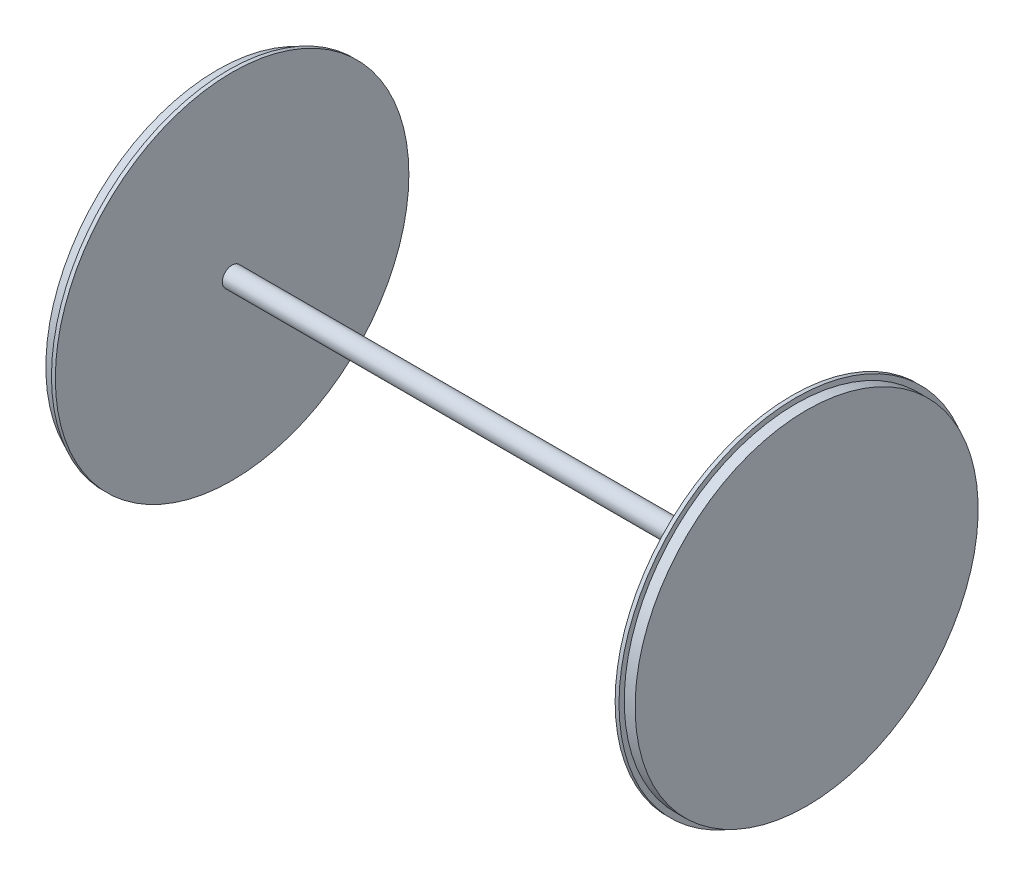
ISO-10303-21;
HEADER;
FILE_DESCRIPTION(('STEP AP214'),'2;1');
FILE_NAME('part.step','',(''),(''),'','','');
FILE_SCHEMA(('AUTOMOTIVE_DESIGN { 1 0 10303 214 1 1 1 1 }'));
ENDSEC;
DATA;
#1=APPLICATION_CONTEXT('core data for automotive mechanical design processes');
#2=APPLICATION_PROTOCOL_DEFINITION('international standard','automotive_design',2000,#1);
#3=PRODUCT_CONTEXT('',#1,'mechanical');
#4=PRODUCT('Part','Part','',(#3));
#5=PRODUCT_RELATED_PRODUCT_CATEGORY('part','',(#4));
#6=PRODUCT_DEFINITION_FORMATION('','',#4);
#7=PRODUCT_DEFINITION_CONTEXT('part definition',#1,'design');
#8=PRODUCT_DEFINITION('design','',#6,#7);
#9=PRODUCT_DEFINITION_SHAPE('','',#8);
#10=(LENGTH_UNIT() NAMED_UNIT(*) SI_UNIT(.MILLI.,.METRE.));
#11=(NAMED_UNIT(*) PLANE_ANGLE_UNIT() SI_UNIT($,.RADIAN.));
#12=(NAMED_UNIT(*) SI_UNIT($,.STERADIAN.) SOLID_ANGLE_UNIT());
#13=UNCERTAINTY_MEASURE_WITH_UNIT(LENGTH_MEASURE(1.E-05),#10,'distance_accuracy_value','');
#14=(GEOMETRIC_REPRESENTATION_CONTEXT(3) GLOBAL_UNCERTAINTY_ASSIGNED_CONTEXT((#13)) GLOBAL_UNIT_ASSIGNED_CONTEXT((#10,
#11,#12)) REPRESENTATION_CONTEXT('',''));
#15=CARTESIAN_POINT('',(0.,0.,0.));
#16=DIRECTION('',(0.,0.,1.));
#17=DIRECTION('',(1.,0.,0.));
#18=AXIS2_PLACEMENT_3D('',#15,#16,#17);
#19=CARTESIAN_POINT('',(0.,887.22,0.));
#20=DIRECTION('',(1.,0.,0.));
#21=DIRECTION('',(0.,1.,0.));
#22=AXIS2_PLACEMENT_3D('',#19,#20,#21);
#23=PLANE('',#22);
#24=CARTESIAN_POINT('',(1.08653113313951E-13,0.,0.));
#25=DIRECTION('',(1.,0.,0.));
#26=DIRECTION('',(0.,1.,0.));
#27=AXIS2_PLACEMENT_3D('',#24,#25,#26);
#28=CIRCLE('',#27,887.22);
#29=CARTESIAN_POINT('',(0.,887.22,0.));
#30=VERTEX_POINT('',#29);
#31=EDGE_CURVE('E65',#30,#30,#28,.T.);
#32=ORIENTED_EDGE('',*,*,#31,.T.);
#33=EDGE_LOOP('',(#32));
#34=FACE_BOUND('',#33,.T.);
#35=ADVANCED_FACE('F31',(#34),#23,.T.);
#36=CARTESIAN_POINT('',(-3048.,-3.73272344380113E-13,0.));
#37=DIRECTION('',(-1.,0.,0.));
#38=DIRECTION('',(0.,-1.,0.));
#39=AXIS2_PLACEMENT_3D('',#36,#37,#38);
#40=PLANE('',#39);
#41=CARTESIAN_POINT('',(-3048.,-3.73272344380113E-13,0.));
#42=DIRECTION('',(1.,0.,0.));
#43=DIRECTION('',(0.,1.,0.));
#44=AXIS2_PLACEMENT_3D('',#41,#42,#43);
#45=CIRCLE('',#44,887.22);
#46=CARTESIAN_POINT('',(-3048.,887.22,0.));
#47=VERTEX_POINT('',#46);
#48=EDGE_CURVE('E10',#47,#47,#45,.T.);
#49=ORIENTED_EDGE('',*,*,#48,.F.);
#50=EDGE_LOOP('',(#49));
#51=FACE_BOUND('',#50,.T.);
#52=ADVANCED_FACE('F82',(#51),#40,.T.);
#53=CARTESIAN_POINT('',(0.,0.,0.));
#54=DIRECTION('',(1.,0.,0.));
#55=DIRECTION('',(0.,1.,0.));
#56=AXIS2_PLACEMENT_3D('',#53,#54,#55);
#57=CYLINDRICAL_SURFACE('',#56,887.22);
#58=ORIENTED_EDGE('',*,*,#48,.T.);
#59=EDGE_LOOP('',(#58));
#60=FACE_BOUND('',#59,.T.);
#61=CARTESIAN_POINT('',(-2991.8,-3.66389829368905E-13,0.));
#62=DIRECTION('',(1.,0.,0.));
#63=DIRECTION('',(0.,1.,0.));
#64=AXIS2_PLACEMENT_3D('',#61,#62,#63);
#65=CIRCLE('',#64,887.22);
#66=CARTESIAN_POINT('',(-2991.8,887.22,0.));
#67=VERTEX_POINT('',#66);
#68=EDGE_CURVE('E37',#67,#67,#65,.T.);
#69=ORIENTED_EDGE('',*,*,#68,.F.);
#70=EDGE_LOOP('',(#69));
#71=FACE_BOUND('',#70,.T.);
#72=ADVANCED_FACE('F86',(#60,#71),#57,.T.);
#73=CARTESIAN_POINT('',(-2991.8,914.4,0.));
#74=DIRECTION('',(-1.,0.,0.));
#75=DIRECTION('',(0.,-1.,0.));
#76=AXIS2_PLACEMENT_3D('',#73,#74,#75);
#77=PLANE('',#76);
#78=ORIENTED_EDGE('',*,*,#68,.T.);
#79=EDGE_LOOP('',(#78));
#80=FACE_BOUND('',#79,.T.);
#81=CARTESIAN_POINT('',(-2991.8,-3.66389829368905E-13,0.));
#82=DIRECTION('',(1.,0.,0.));
#83=DIRECTION('',(0.,1.,0.));
#84=AXIS2_PLACEMENT_3D('',#81,#82,#83);
#85=CIRCLE('',#84,914.4);
#86=CARTESIAN_POINT('',(-2991.8,914.4,0.));
#87=VERTEX_POINT('',#86);
#88=EDGE_CURVE('E41',#87,#87,#85,.T.);
#89=ORIENTED_EDGE('',*,*,#88,.F.);
#90=EDGE_LOOP('',(#89));
#91=FACE_BOUND('',#90,.T.);
#92=ADVANCED_FACE('F91',(#80,#91),#77,.T.);
#93=CARTESIAN_POINT('',(0.,0.,0.));
#94=DIRECTION('',(1.,0.,0.));
#95=DIRECTION('',(0.,1.,0.));
#96=AXIS2_PLACEMENT_3D('',#93,#94,#95);
#97=CYLINDRICAL_SURFACE('',#96,914.4);
#98=ORIENTED_EDGE('',*,*,#88,.T.);
#99=EDGE_LOOP('',(#98));
#100=FACE_BOUND('',#99,.T.);
#101=CARTESIAN_POINT('',(-2971.8,-3.6394053577061E-13,0.));
#102=DIRECTION('',(1.,0.,0.));
#103=DIRECTION('',(0.,1.,0.));
#104=AXIS2_PLACEMENT_3D('',#101,#102,#103);
#105=CIRCLE('',#104,914.4);
#106=CARTESIAN_POINT('',(-2971.8,914.4,0.));
#107=VERTEX_POINT('',#106);
#108=EDGE_CURVE('E45',#107,#107,#105,.T.);
#109=ORIENTED_EDGE('',*,*,#108,.F.);
#110=EDGE_LOOP('',(#109));
#111=FACE_BOUND('',#110,.T.);
#112=ADVANCED_FACE('F96',(#100,#111),#97,.T.);
#113=CARTESIAN_POINT('',(-2971.8,914.4,0.));
#114=DIRECTION('',(1.,0.,0.));
#115=DIRECTION('',(0.,1.,0.));
#116=AXIS2_PLACEMENT_3D('',#113,#114,#115);
#117=PLANE('',#116);
#118=ORIENTED_EDGE('',*,*,#108,.T.);
#119=EDGE_LOOP('',(#118));
#120=FACE_BOUND('',#119,.T.);
#121=CARTESIAN_POINT('',(-2971.8,-3.63940535770611E-13,0.));
#122=DIRECTION('',(1.,0.,0.));
#123=DIRECTION('',(0.,1.,0.));
#124=AXIS2_PLACEMENT_3D('',#121,#122,#123);
#125=CIRCLE('',#124,50.8000000000003);
#126=CARTESIAN_POINT('',(-2971.8,50.8,0.));
#127=VERTEX_POINT('',#126);
#128=EDGE_CURVE('E50',#127,#127,#125,.T.);
#129=ORIENTED_EDGE('',*,*,#128,.F.);
#130=EDGE_LOOP('',(#129));
#131=FACE_BOUND('',#130,.T.);
#132=ADVANCED_FACE('F99',(#120,#131),#117,.T.);
#133=CARTESIAN_POINT('',(0.,0.,0.));
#134=DIRECTION('',(1.,0.,0.));
#135=DIRECTION('',(0.,1.,0.));
#136=AXIS2_PLACEMENT_3D('',#133,#134,#135);
#137=CYLINDRICAL_SURFACE('',#136,50.8000000000002);
#138=ORIENTED_EDGE('',*,*,#128,.T.);
#139=EDGE_LOOP('',(#138));
#140=FACE_BOUND('',#139,.T.);
#141=CARTESIAN_POINT('',(-76.2,0.,0.));
#142=DIRECTION('',(1.,0.,0.));
#143=DIRECTION('',(0.,1.,0.));
#144=AXIS2_PLACEMENT_3D('',#141,#142,#143);
#145=CIRCLE('',#144,50.8);
#146=CARTESIAN_POINT('',(-76.2,50.8,0.));
#147=VERTEX_POINT('',#146);
#148=EDGE_CURVE('E53',#147,#147,#145,.T.);
#149=ORIENTED_EDGE('',*,*,#148,.F.);
#150=EDGE_LOOP('',(#149));
#151=FACE_BOUND('',#150,.T.);
#152=ADVANCED_FACE('F103',(#140,#151),#137,.T.);
#153=CARTESIAN_POINT('',(-76.1999999999999,50.8,0.));
#154=DIRECTION('',(-1.,0.,0.));
#155=DIRECTION('',(0.,-1.,0.));
#156=AXIS2_PLACEMENT_3D('',#153,#154,#155);
#157=PLANE('',#156);
#158=ORIENTED_EDGE('',*,*,#148,.T.);
#159=EDGE_LOOP('',(#158));
#160=FACE_BOUND('',#159,.T.);
#161=CARTESIAN_POINT('',(-76.1999999999999,0.,0.));
#162=DIRECTION('',(1.,0.,0.));
#163=DIRECTION('',(0.,1.,0.));
#164=AXIS2_PLACEMENT_3D('',#161,#162,#163);
#165=CIRCLE('',#164,914.4);
#166=CARTESIAN_POINT('',(-76.2,914.4,0.));
#167=VERTEX_POINT('',#166);
#168=EDGE_CURVE('E56',#167,#167,#165,.T.);
#169=ORIENTED_EDGE('',*,*,#168,.F.);
#170=EDGE_LOOP('',(#169));
#171=FACE_BOUND('',#170,.T.);
#172=ADVANCED_FACE('F107',(#160,#171),#157,.T.);
#173=CARTESIAN_POINT('',(0.,0.,0.));
#174=DIRECTION('',(1.,0.,0.));
#175=DIRECTION('',(0.,1.,0.));
#176=AXIS2_PLACEMENT_3D('',#173,#174,#175);
#177=CYLINDRICAL_SURFACE('',#176,914.4);
#178=ORIENTED_EDGE('',*,*,#168,.T.);
#179=EDGE_LOOP('',(#178));
#180=FACE_BOUND('',#179,.T.);
#181=CARTESIAN_POINT('',(-56.1999999999999,0.,0.));
#182=DIRECTION('',(1.,0.,0.));
#183=DIRECTION('',(0.,1.,0.));
#184=AXIS2_PLACEMENT_3D('',#181,#182,#183);
#185=CIRCLE('',#184,914.4);
#186=CARTESIAN_POINT('',(-56.2,914.4,0.));
#187=VERTEX_POINT('',#186);
#188=EDGE_CURVE('E59',#187,#187,#185,.T.);
#189=ORIENTED_EDGE('',*,*,#188,.F.);
#190=EDGE_LOOP('',(#189));
#191=FACE_BOUND('',#190,.T.);
#192=ADVANCED_FACE('F78',(#180,#191),#177,.T.);
#193=CARTESIAN_POINT('',(-56.2,914.4,0.));
#194=DIRECTION('',(1.,0.,0.));
#195=DIRECTION('',(0.,1.,0.));
#196=AXIS2_PLACEMENT_3D('',#193,#194,#195);
#197=PLANE('',#196);
#198=ORIENTED_EDGE('',*,*,#188,.T.);
#199=EDGE_LOOP('',(#198));
#200=FACE_BOUND('',#199,.T.);
#201=CARTESIAN_POINT('',(-56.1999999999999,0.,0.));
#202=DIRECTION('',(1.,0.,0.));
#203=DIRECTION('',(0.,1.,0.));
#204=AXIS2_PLACEMENT_3D('',#201,#202,#203);
#205=CIRCLE('',#204,887.22);
#206=CARTESIAN_POINT('',(-56.2,887.22,0.));
#207=VERTEX_POINT('',#206);
#208=EDGE_CURVE('E62',#207,#207,#205,.T.);
#209=ORIENTED_EDGE('',*,*,#208,.F.);
#210=EDGE_LOOP('',(#209));
#211=FACE_BOUND('',#210,.T.);
#212=ADVANCED_FACE('F72',(#200,#211),#197,.T.);
#213=CARTESIAN_POINT('',(0.,0.,0.));
#214=DIRECTION('',(1.,0.,0.));
#215=DIRECTION('',(0.,1.,0.));
#216=AXIS2_PLACEMENT_3D('',#213,#214,#215);
#217=CYLINDRICAL_SURFACE('',#216,887.22);
#218=ORIENTED_EDGE('',*,*,#208,.T.);
#219=EDGE_LOOP('',(#218));
#220=FACE_BOUND('',#219,.T.);
#221=ORIENTED_EDGE('',*,*,#31,.F.);
#222=EDGE_LOOP('',(#221));
#223=FACE_BOUND('',#222,.T.);
#224=ADVANCED_FACE('F70',(#220,#223),#217,.T.);
#225=CLOSED_SHELL('',(#35,#52,#72,#92,#112,#132,#152,#172,#192,#212,#224));
#226=MANIFOLD_SOLID_BREP('B2',#225);
#227=ADVANCED_BREP_SHAPE_REPRESENTATION('',(#18,#226),#14);
#228=SHAPE_DEFINITION_REPRESENTATION(#9,#227);
ENDSEC;
END-ISO-10303-21;
